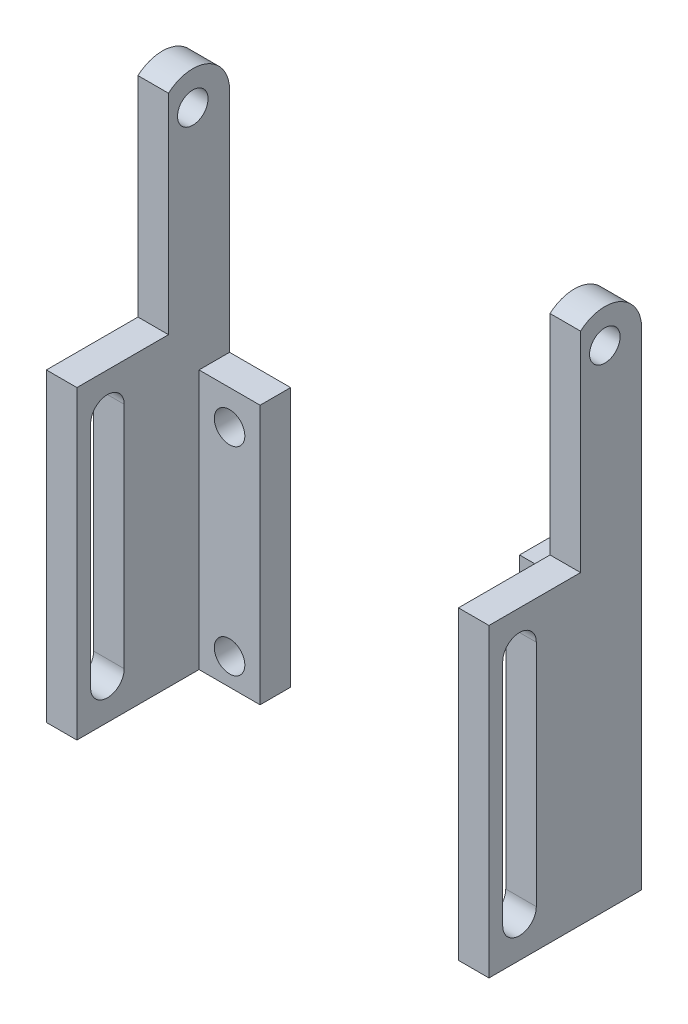
ISO-10303-21;
HEADER;
FILE_DESCRIPTION(('STEP AP214'),'2;1');
FILE_NAME('part.step','',(''),(''),'','','');
FILE_SCHEMA(('AUTOMOTIVE_DESIGN { 1 0 10303 214 1 1 1 1 }'));
ENDSEC;
DATA;
#1=APPLICATION_CONTEXT('core data for automotive mechanical design processes');
#2=APPLICATION_PROTOCOL_DEFINITION('international standard','automotive_design',2000,#1);
#3=PRODUCT_CONTEXT('',#1,'mechanical');
#4=PRODUCT('Part','Part','',(#3));
#5=PRODUCT_RELATED_PRODUCT_CATEGORY('part','',(#4));
#6=PRODUCT_DEFINITION_FORMATION('','',#4);
#7=PRODUCT_DEFINITION_CONTEXT('part definition',#1,'design');
#8=PRODUCT_DEFINITION('design','',#6,#7);
#9=PRODUCT_DEFINITION_SHAPE('','',#8);
#10=(LENGTH_UNIT() NAMED_UNIT(*) SI_UNIT(.MILLI.,.METRE.));
#11=(NAMED_UNIT(*) PLANE_ANGLE_UNIT() SI_UNIT($,.RADIAN.));
#12=(NAMED_UNIT(*) SI_UNIT($,.STERADIAN.) SOLID_ANGLE_UNIT());
#13=UNCERTAINTY_MEASURE_WITH_UNIT(LENGTH_MEASURE(1.E-05),#10,'distance_accuracy_value','');
#14=(GEOMETRIC_REPRESENTATION_CONTEXT(3) GLOBAL_UNCERTAINTY_ASSIGNED_CONTEXT((#13)) GLOBAL_UNIT_ASSIGNED_CONTEXT((#10,
#11,#12)) REPRESENTATION_CONTEXT('',''));
#15=CARTESIAN_POINT('',(0.,0.,0.));
#16=DIRECTION('',(0.,0.,1.));
#17=DIRECTION('',(1.,0.,0.));
#18=AXIS2_PLACEMENT_3D('',#15,#16,#17);
#19=CARTESIAN_POINT('',(0.,0.,0.));
#20=DIRECTION('',(0.,0.,-1.));
#21=DIRECTION('',(-1.,0.,0.));
#22=AXIS2_PLACEMENT_3D('',#19,#20,#21);
#23=PLANE('',#22);
#24=DIRECTION('',(1.,0.,0.));
#25=VECTOR('',#24,1.);
#26=CARTESIAN_POINT('',(-38.9966904051501,-4.30136409154109,0.));
#27=LINE('',#26,#25);
#28=CARTESIAN_POINT('',(-38.9966904051501,-4.30136409154109,0.));
#29=VERTEX_POINT('',#28);
#30=CARTESIAN_POINT('',(-36.9966904051501,-4.30136409154109,0.));
#31=VERTEX_POINT('',#30);
#32=EDGE_CURVE('E148',#29,#31,#27,.T.);
#33=ORIENTED_EDGE('',*,*,#32,.F.);
#34=DIRECTION('',(0.,-1.,0.));
#35=VECTOR('',#34,1.);
#36=CARTESIAN_POINT('',(-38.9966904051501,-3.00000000000008,0.));
#37=LINE('',#36,#35);
#38=CARTESIAN_POINT('',(-38.9966904051501,-18.0000000000001,0.));
#39=VERTEX_POINT('',#38);
#40=EDGE_CURVE('E56',#29,#39,#37,.T.);
#41=ORIENTED_EDGE('',*,*,#40,.T.);
#42=DIRECTION('',(-1.,0.,0.));
#43=VECTOR('',#42,1.);
#44=CARTESIAN_POINT('',(0.,-18.0000000000001,0.));
#45=LINE('',#44,#43);
#46=CARTESIAN_POINT('',(-36.9966904051501,-18.0000000000001,0.));
#47=VERTEX_POINT('',#46);
#48=EDGE_CURVE('E209',#47,#39,#45,.T.);
#49=ORIENTED_EDGE('',*,*,#48,.F.);
#50=DIRECTION('',(0.,-1.,0.));
#51=VECTOR('',#50,1.);
#52=CARTESIAN_POINT('',(-36.9966904051501,-3.00000000000008,0.));
#53=LINE('',#52,#51);
#54=EDGE_CURVE('E12',#31,#47,#53,.T.);
#55=ORIENTED_EDGE('',*,*,#54,.F.);
#56=EDGE_LOOP('',(#33,#41,#49,#55));
#57=FACE_BOUND('',#56,.T.);
#58=ADVANCED_FACE('F47',(#57),#23,.F.);
#59=CARTESIAN_POINT('',(-36.9966904051501,-3.00000000000008,-4.));
#60=DIRECTION('',(-1.,0.,0.));
#61=DIRECTION('',(0.,-1.,0.));
#62=AXIS2_PLACEMENT_3D('',#59,#60,#61);
#63=PLANE('',#62);
#64=CARTESIAN_POINT('',(-36.9966904051501,-5.91214564336537,-1.59013377144661));
#65=DIRECTION('',(-1.,0.,0.));
#66=DIRECTION('',(0.,-1.,0.));
#67=AXIS2_PLACEMENT_3D('',#64,#65,#66);
#68=CIRCLE('',#67,1.);
#69=CARTESIAN_POINT('',(-36.9966904051501,-6.91214564336537,-1.59013377144661));
#70=VERTEX_POINT('',#69);
#71=EDGE_CURVE('E156',#70,#70,#68,.T.);
#72=ORIENTED_EDGE('',*,*,#71,.T.);
#73=EDGE_LOOP('',(#72));
#74=FACE_BOUND('',#73,.T.);
#75=CARTESIAN_POINT('',(-36.9966904051501,-35.5000000000001,3.99999999999999));
#76=DIRECTION('',(-1.,0.,0.));
#77=DIRECTION('',(0.,-1.,0.));
#78=AXIS2_PLACEMENT_3D('',#75,#76,#77);
#79=CIRCLE('',#78,1.1);
#80=CARTESIAN_POINT('',(-36.9966904051501,-35.5000000000001,2.9));
#81=VERTEX_POINT('',#80);
#82=CARTESIAN_POINT('',(-36.9966904051501,-35.5000000000001,5.09999999999999));
#83=VERTEX_POINT('',#82);
#84=EDGE_CURVE('E230',#81,#83,#79,.T.);
#85=ORIENTED_EDGE('',*,*,#84,.T.);
#86=DIRECTION('',(0.,1.,0.));
#87=VECTOR('',#86,1.);
#88=CARTESIAN_POINT('',(-36.9966904051501,-3.00000000000009,5.1));
#89=LINE('',#88,#87);
#90=CARTESIAN_POINT('',(-36.9966904051501,-20.5000000000001,5.1));
#91=VERTEX_POINT('',#90);
#92=EDGE_CURVE('E213',#83,#91,#89,.T.);
#93=ORIENTED_EDGE('',*,*,#92,.T.);
#94=CARTESIAN_POINT('',(-36.9966904051501,-20.5000000000001,4.));
#95=DIRECTION('',(-1.,0.,0.));
#96=DIRECTION('',(0.,-1.,0.));
#97=AXIS2_PLACEMENT_3D('',#94,#95,#96);
#98=CIRCLE('',#97,1.1);
#99=CARTESIAN_POINT('',(-36.9966904051501,-20.5000000000001,2.9));
#100=VERTEX_POINT('',#99);
#101=EDGE_CURVE('E225',#91,#100,#98,.T.);
#102=ORIENTED_EDGE('',*,*,#101,.T.);
#103=DIRECTION('',(0.,1.,0.));
#104=VECTOR('',#103,1.);
#105=CARTESIAN_POINT('',(-36.9966904051501,-3.00000000000009,2.90000000000001));
#106=LINE('',#105,#104);
#107=EDGE_CURVE('E228',#81,#100,#106,.T.);
#108=ORIENTED_EDGE('',*,*,#107,.F.);
#109=EDGE_LOOP('',(#85,#93,#102,#108));
#110=FACE_BOUND('',#109,.T.);
#111=CARTESIAN_POINT('',(-36.9966904051501,-6.11214564336537,-1.59013377144661));
#112=DIRECTION('',(-1.,0.,0.));
#113=DIRECTION('',(0.,-1.,0.));
#114=AXIS2_PLACEMENT_3D('',#111,#112,#113);
#115=CIRCLE('',#114,2.40986622855339);
#116=CARTESIAN_POINT('',(-36.9966904051501,-6.11214564336537,-4.));
#117=VERTEX_POINT('',#116);
#118=EDGE_CURVE('E64',#31,#117,#115,.T.);
#119=ORIENTED_EDGE('',*,*,#118,.F.);
#120=ORIENTED_EDGE('',*,*,#54,.T.);
#121=DIRECTION('',(0.,0.,-1.));
#122=VECTOR('',#121,1.);
#123=CARTESIAN_POINT('',(-36.9966904051501,-18.0000000000001,6.));
#124=LINE('',#123,#122);
#125=CARTESIAN_POINT('',(-36.9966904051501,-18.0000000000001,6.));
#126=VERTEX_POINT('',#125);
#127=EDGE_CURVE('E196',#126,#47,#124,.T.);
#128=ORIENTED_EDGE('',*,*,#127,.F.);
#129=DIRECTION('',(0.,1.,0.));
#130=VECTOR('',#129,1.);
#131=CARTESIAN_POINT('',(-36.9966904051501,0.,6.));
#132=LINE('',#131,#130);
#133=CARTESIAN_POINT('',(-36.9966904051501,-38.0000000000001,6.));
#134=VERTEX_POINT('',#133);
#135=EDGE_CURVE('E212',#134,#126,#132,.T.);
#136=ORIENTED_EDGE('',*,*,#135,.F.);
#137=DIRECTION('',(0.,0.,1.));
#138=VECTOR('',#137,1.);
#139=CARTESIAN_POINT('',(-36.9966904051501,-38.0000000000001,-4.));
#140=LINE('',#139,#138);
#141=CARTESIAN_POINT('',(-36.9966904051501,-38.0000000000001,-2.));
#142=VERTEX_POINT('',#141);
#143=EDGE_CURVE('E163',#142,#134,#140,.T.);
#144=ORIENTED_EDGE('',*,*,#143,.F.);
#145=DIRECTION('',(0.,-1.,0.));
#146=VECTOR('',#145,1.);
#147=CARTESIAN_POINT('',(-36.9966904051501,0.,-2.));
#148=LINE('',#147,#146);
#149=CARTESIAN_POINT('',(-36.9966904051501,-21.0000000000001,-2.));
#150=VERTEX_POINT('',#149);
#151=EDGE_CURVE('E187',#150,#142,#148,.T.);
#152=ORIENTED_EDGE('',*,*,#151,.F.);
#153=DIRECTION('',(0.,0.,-1.));
#154=VECTOR('',#153,1.);
#155=CARTESIAN_POINT('',(-36.9966904051501,-21.0000000000001,-2.));
#156=LINE('',#155,#154);
#157=CARTESIAN_POINT('',(-36.9966904051501,-21.0000000000001,-4.));
#158=VERTEX_POINT('',#157);
#159=EDGE_CURVE('E172',#150,#158,#156,.T.);
#160=ORIENTED_EDGE('',*,*,#159,.T.);
#161=DIRECTION('',(0.,-1.,0.));
#162=VECTOR('',#161,1.);
#163=CARTESIAN_POINT('',(-36.9966904051501,-3.00000000000008,-4.));
#164=LINE('',#163,#162);
#165=EDGE_CURVE('E51',#117,#158,#164,.T.);
#166=ORIENTED_EDGE('',*,*,#165,.F.);
#167=EDGE_LOOP('',(#119,#120,#128,#136,#144,#152,#160,#166));
#168=FACE_BOUND('',#167,.T.);
#169=ADVANCED_FACE('F271',(#74,#110,#168),#63,.F.);
#170=CARTESIAN_POINT('',(-38.9966904051501,-3.00000000000008,-4.));
#171=DIRECTION('',(-1.,0.,0.));
#172=DIRECTION('',(0.,0.,1.));
#173=AXIS2_PLACEMENT_3D('',#170,#171,#172);
#174=PLANE('',#173);
#175=CARTESIAN_POINT('',(-38.9966904051501,-5.91214564336537,-1.59013377144661));
#176=DIRECTION('',(1.,0.,0.));
#177=DIRECTION('',(0.,1.,0.));
#178=AXIS2_PLACEMENT_3D('',#175,#176,#177);
#179=CIRCLE('',#178,1.);
#180=CARTESIAN_POINT('',(-38.9966904051501,-4.91214564336537,-1.59013377144661));
#181=VERTEX_POINT('',#180);
#182=EDGE_CURVE('E259',#181,#181,#179,.T.);
#183=ORIENTED_EDGE('',*,*,#182,.T.);
#184=EDGE_LOOP('',(#183));
#185=FACE_BOUND('',#184,.T.);
#186=DIRECTION('',(0.,-1.,0.));
#187=VECTOR('',#186,1.);
#188=CARTESIAN_POINT('',(-38.9966904051501,0.,5.10000000000001));
#189=LINE('',#188,#187);
#190=CARTESIAN_POINT('',(-38.9966904051501,-20.5000000000001,5.1));
#191=VERTEX_POINT('',#190);
#192=CARTESIAN_POINT('',(-38.9966904051501,-35.5000000000001,5.1));
#193=VERTEX_POINT('',#192);
#194=EDGE_CURVE('E252',#191,#193,#189,.T.);
#195=ORIENTED_EDGE('',*,*,#194,.T.);
#196=CARTESIAN_POINT('',(-38.9966904051501,-35.5000000000001,3.99999999999999));
#197=DIRECTION('',(1.,0.,0.));
#198=DIRECTION('',(0.,1.,0.));
#199=AXIS2_PLACEMENT_3D('',#196,#197,#198);
#200=CIRCLE('',#199,1.1);
#201=CARTESIAN_POINT('',(-38.9966904051501,-35.5000000000001,2.9));
#202=VERTEX_POINT('',#201);
#203=EDGE_CURVE('E249',#193,#202,#200,.T.);
#204=ORIENTED_EDGE('',*,*,#203,.T.);
#205=DIRECTION('',(0.,-1.,0.));
#206=VECTOR('',#205,1.);
#207=CARTESIAN_POINT('',(-38.9966904051501,0.,2.90000000000001));
#208=LINE('',#207,#206);
#209=CARTESIAN_POINT('',(-38.9966904051501,-20.5000000000001,2.9));
#210=VERTEX_POINT('',#209);
#211=EDGE_CURVE('E246',#210,#202,#208,.T.);
#212=ORIENTED_EDGE('',*,*,#211,.F.);
#213=CARTESIAN_POINT('',(-38.9966904051501,-20.5000000000001,4.));
#214=DIRECTION('',(1.,0.,0.));
#215=DIRECTION('',(0.,1.,0.));
#216=AXIS2_PLACEMENT_3D('',#213,#214,#215);
#217=CIRCLE('',#216,1.1);
#218=EDGE_CURVE('E236',#210,#191,#217,.T.);
#219=ORIENTED_EDGE('',*,*,#218,.T.);
#220=EDGE_LOOP('',(#195,#204,#212,#219));
#221=FACE_BOUND('',#220,.T.);
#222=ORIENTED_EDGE('',*,*,#40,.F.);
#223=CARTESIAN_POINT('',(-38.9966904051501,-6.11214564336537,-1.59013377144661));
#224=DIRECTION('',(1.,0.,0.));
#225=DIRECTION('',(0.,1.,0.));
#226=AXIS2_PLACEMENT_3D('',#223,#224,#225);
#227=CIRCLE('',#226,2.40986622855339);
#228=CARTESIAN_POINT('',(-38.9966904051501,-6.11214564336537,-4.));
#229=VERTEX_POINT('',#228);
#230=EDGE_CURVE('E143',#229,#29,#227,.T.);
#231=ORIENTED_EDGE('',*,*,#230,.F.);
#232=DIRECTION('',(0.,-1.,0.));
#233=VECTOR('',#232,1.);
#234=CARTESIAN_POINT('',(-38.9966904051501,-3.00000000000008,-4.));
#235=LINE('',#234,#233);
#236=CARTESIAN_POINT('',(-38.9966904051501,-38.0000000000001,-4.));
#237=VERTEX_POINT('',#236);
#238=EDGE_CURVE('E153',#229,#237,#235,.T.);
#239=ORIENTED_EDGE('',*,*,#238,.T.);
#240=DIRECTION('',(0.,0.,1.));
#241=VECTOR('',#240,1.);
#242=CARTESIAN_POINT('',(-38.9966904051501,-38.0000000000001,-4.));
#243=LINE('',#242,#241);
#244=CARTESIAN_POINT('',(-38.9966904051501,-38.0000000000001,6.));
#245=VERTEX_POINT('',#244);
#246=EDGE_CURVE('E161',#237,#245,#243,.T.);
#247=ORIENTED_EDGE('',*,*,#246,.T.);
#248=DIRECTION('',(0.,-1.,0.));
#249=VECTOR('',#248,1.);
#250=CARTESIAN_POINT('',(-38.9966904051501,0.,6.));
#251=LINE('',#250,#249);
#252=CARTESIAN_POINT('',(-38.9966904051501,-18.0000000000001,6.));
#253=VERTEX_POINT('',#252);
#254=EDGE_CURVE('E216',#253,#245,#251,.T.);
#255=ORIENTED_EDGE('',*,*,#254,.F.);
#256=DIRECTION('',(0.,0.,-1.));
#257=VECTOR('',#256,1.);
#258=CARTESIAN_POINT('',(-38.9966904051501,-18.0000000000001,6.));
#259=LINE('',#258,#257);
#260=EDGE_CURVE('E206',#253,#39,#259,.T.);
#261=ORIENTED_EDGE('',*,*,#260,.T.);
#262=EDGE_LOOP('',(#222,#231,#239,#247,#255,#261));
#263=FACE_BOUND('',#262,.T.);
#264=ADVANCED_FACE('F152',(#185,#221,#263),#174,.T.);
#265=CARTESIAN_POINT('',(0.,0.,-4.));
#266=DIRECTION('',(0.,0.,-1.));
#267=DIRECTION('',(-1.,0.,0.));
#268=AXIS2_PLACEMENT_3D('',#265,#266,#267);
#269=PLANE('',#268);
#270=CARTESIAN_POINT('',(-34.9966904051501,-36.2461665401633,-4.));
#271=DIRECTION('',(0.,0.,-1.));
#272=DIRECTION('',(-1.,0.,0.));
#273=AXIS2_PLACEMENT_3D('',#270,#271,#272);
#274=CIRCLE('',#273,1.00000000001105);
#275=CARTESIAN_POINT('',(-35.9966904051611,-36.2461665401633,-4.));
#276=VERTEX_POINT('',#275);
#277=EDGE_CURVE('E199',#276,#276,#274,.T.);
#278=ORIENTED_EDGE('',*,*,#277,.F.);
#279=EDGE_LOOP('',(#278));
#280=FACE_BOUND('',#279,.T.);
#281=CARTESIAN_POINT('',(-34.9966904051501,-23.2461665401633,-4.));
#282=DIRECTION('',(0.,0.,-1.));
#283=DIRECTION('',(-1.,0.,0.));
#284=AXIS2_PLACEMENT_3D('',#281,#282,#283);
#285=CIRCLE('',#284,1.00000000001105);
#286=CARTESIAN_POINT('',(-35.9966904051611,-23.2461665401633,-4.));
#287=VERTEX_POINT('',#286);
#288=EDGE_CURVE('E192',#287,#287,#285,.T.);
#289=ORIENTED_EDGE('',*,*,#288,.F.);
#290=EDGE_LOOP('',(#289));
#291=FACE_BOUND('',#290,.T.);
#292=ORIENTED_EDGE('',*,*,#238,.F.);
#293=DIRECTION('',(1.,0.,0.));
#294=VECTOR('',#293,1.);
#295=CARTESIAN_POINT('',(-38.9966904051501,-6.11214564336537,-4.));
#296=LINE('',#295,#294);
#297=EDGE_CURVE('E140',#229,#117,#296,.T.);
#298=ORIENTED_EDGE('',*,*,#297,.T.);
#299=ORIENTED_EDGE('',*,*,#165,.T.);
#300=DIRECTION('',(1.,0.,0.));
#301=VECTOR('',#300,1.);
#302=CARTESIAN_POINT('',(0.,-21.0000000000001,-4.));
#303=LINE('',#302,#301);
#304=CARTESIAN_POINT('',(-32.9966904051501,-21.0000000000001,-4.));
#305=VERTEX_POINT('',#304);
#306=EDGE_CURVE('E177',#158,#305,#303,.T.);
#307=ORIENTED_EDGE('',*,*,#306,.T.);
#308=DIRECTION('',(0.,1.,0.));
#309=VECTOR('',#308,1.);
#310=CARTESIAN_POINT('',(-32.9966904051501,0.,-4.));
#311=LINE('',#310,#309);
#312=CARTESIAN_POINT('',(-32.9966904051501,-38.0000000000001,-4.));
#313=VERTEX_POINT('',#312);
#314=EDGE_CURVE('E181',#313,#305,#311,.T.);
#315=ORIENTED_EDGE('',*,*,#314,.F.);
#316=DIRECTION('',(1.,0.,0.));
#317=VECTOR('',#316,1.);
#318=CARTESIAN_POINT('',(-38.9966904051501,-38.0000000000001,-4.));
#319=LINE('',#318,#317);
#320=EDGE_CURVE('E160',#237,#313,#319,.T.);
#321=ORIENTED_EDGE('',*,*,#320,.F.);
#322=EDGE_LOOP('',(#292,#298,#299,#307,#315,#321));
#323=FACE_BOUND('',#322,.T.);
#324=ADVANCED_FACE('F49',(#280,#291,#323),#269,.T.);
#325=CARTESIAN_POINT('',(-38.9966904051501,-38.0000000000001,-4.));
#326=DIRECTION('',(0.,-1.,0.));
#327=DIRECTION('',(1.,0.,0.));
#328=AXIS2_PLACEMENT_3D('',#325,#326,#327);
#329=PLANE('',#328);
#330=ORIENTED_EDGE('',*,*,#143,.T.);
#331=DIRECTION('',(1.,0.,0.));
#332=VECTOR('',#331,1.);
#333=CARTESIAN_POINT('',(1.31838984174237E-13,-38.,6.));
#334=LINE('',#333,#332);
#335=EDGE_CURVE('E208',#245,#134,#334,.T.);
#336=ORIENTED_EDGE('',*,*,#335,.F.);
#337=ORIENTED_EDGE('',*,*,#246,.F.);
#338=ORIENTED_EDGE('',*,*,#320,.T.);
#339=DIRECTION('',(0.,0.,-1.));
#340=VECTOR('',#339,1.);
#341=CARTESIAN_POINT('',(-32.9966904051501,-38.0000000000001,-2.));
#342=LINE('',#341,#340);
#343=CARTESIAN_POINT('',(-32.9966904051501,-38.0000000000001,-2.));
#344=VERTEX_POINT('',#343);
#345=EDGE_CURVE('E169',#344,#313,#342,.T.);
#346=ORIENTED_EDGE('',*,*,#345,.F.);
#347=DIRECTION('',(1.,0.,0.));
#348=VECTOR('',#347,1.);
#349=CARTESIAN_POINT('',(0.,-38.0000000000001,-2.));
#350=LINE('',#349,#348);
#351=EDGE_CURVE('E189',#142,#344,#350,.T.);
#352=ORIENTED_EDGE('',*,*,#351,.F.);
#353=EDGE_LOOP('',(#330,#336,#337,#338,#346,#352));
#354=FACE_BOUND('',#353,.T.);
#355=ADVANCED_FACE('F292',(#354),#329,.T.);
#356=CARTESIAN_POINT('',(-32.9966904051501,0.,-2.));
#357=DIRECTION('',(-1.,0.,0.));
#358=DIRECTION('',(0.,0.,1.));
#359=AXIS2_PLACEMENT_3D('',#356,#357,#358);
#360=PLANE('',#359);
#361=ORIENTED_EDGE('',*,*,#314,.T.);
#362=DIRECTION('',(0.,0.,-1.));
#363=VECTOR('',#362,1.);
#364=CARTESIAN_POINT('',(-32.9966904051501,-21.0000000000001,-2.));
#365=LINE('',#364,#363);
#366=CARTESIAN_POINT('',(-32.9966904051501,-21.0000000000001,-2.));
#367=VERTEX_POINT('',#366);
#368=EDGE_CURVE('E168',#367,#305,#365,.T.);
#369=ORIENTED_EDGE('',*,*,#368,.F.);
#370=DIRECTION('',(0.,1.,0.));
#371=VECTOR('',#370,1.);
#372=CARTESIAN_POINT('',(-32.9966904051501,0.,-2.));
#373=LINE('',#372,#371);
#374=EDGE_CURVE('E180',#344,#367,#373,.T.);
#375=ORIENTED_EDGE('',*,*,#374,.F.);
#376=ORIENTED_EDGE('',*,*,#345,.T.);
#377=EDGE_LOOP('',(#361,#369,#375,#376));
#378=FACE_BOUND('',#377,.T.);
#379=ADVANCED_FACE('F304',(#378),#360,.F.);
#380=CARTESIAN_POINT('',(0.,-21.0000000000001,-2.));
#381=DIRECTION('',(0.,1.,0.));
#382=DIRECTION('',(0.,0.,1.));
#383=AXIS2_PLACEMENT_3D('',#380,#381,#382);
#384=PLANE('',#383);
#385=ORIENTED_EDGE('',*,*,#306,.F.);
#386=ORIENTED_EDGE('',*,*,#159,.F.);
#387=DIRECTION('',(1.,0.,0.));
#388=VECTOR('',#387,1.);
#389=CARTESIAN_POINT('',(0.,-21.0000000000001,-2.));
#390=LINE('',#389,#388);
#391=EDGE_CURVE('E173',#150,#367,#390,.T.);
#392=ORIENTED_EDGE('',*,*,#391,.T.);
#393=ORIENTED_EDGE('',*,*,#368,.T.);
#394=EDGE_LOOP('',(#385,#386,#392,#393));
#395=FACE_BOUND('',#394,.T.);
#396=ADVANCED_FACE('F302',(#395),#384,.T.);
#397=CARTESIAN_POINT('',(0.,0.,-2.));
#398=DIRECTION('',(0.,0.,-1.));
#399=DIRECTION('',(-1.,0.,0.));
#400=AXIS2_PLACEMENT_3D('',#397,#398,#399);
#401=PLANE('',#400);
#402=CARTESIAN_POINT('',(-34.9966904051501,-36.2461665401633,-2.));
#403=DIRECTION('',(0.,0.,-1.));
#404=DIRECTION('',(-1.,0.,0.));
#405=AXIS2_PLACEMENT_3D('',#402,#403,#404);
#406=CIRCLE('',#405,1.00000000001105);
#407=CARTESIAN_POINT('',(-35.9966904051611,-36.2461665401633,-2.));
#408=VERTEX_POINT('',#407);
#409=EDGE_CURVE('E184',#408,#408,#406,.T.);
#410=ORIENTED_EDGE('',*,*,#409,.T.);
#411=EDGE_LOOP('',(#410));
#412=FACE_BOUND('',#411,.T.);
#413=CARTESIAN_POINT('',(-34.9966904051501,-23.2461665401633,-2.));
#414=DIRECTION('',(0.,0.,-1.));
#415=DIRECTION('',(-1.,0.,0.));
#416=AXIS2_PLACEMENT_3D('',#413,#414,#415);
#417=CIRCLE('',#416,1.00000000001105);
#418=CARTESIAN_POINT('',(-35.9966904051611,-23.2461665401633,-2.));
#419=VERTEX_POINT('',#418);
#420=EDGE_CURVE('E195',#419,#419,#417,.T.);
#421=ORIENTED_EDGE('',*,*,#420,.T.);
#422=EDGE_LOOP('',(#421));
#423=FACE_BOUND('',#422,.T.);
#424=ORIENTED_EDGE('',*,*,#374,.T.);
#425=ORIENTED_EDGE('',*,*,#391,.F.);
#426=ORIENTED_EDGE('',*,*,#151,.T.);
#427=ORIENTED_EDGE('',*,*,#351,.T.);
#428=EDGE_LOOP('',(#424,#425,#426,#427));
#429=FACE_BOUND('',#428,.T.);
#430=ADVANCED_FACE('F297',(#412,#423,#429),#401,.F.);
#431=CARTESIAN_POINT('',(-34.9966904051501,-23.2461665401633,-2.));
#432=DIRECTION('',(0.,0.,-1.));
#433=DIRECTION('',(-1.,0.,0.));
#434=AXIS2_PLACEMENT_3D('',#431,#432,#433);
#435=CYLINDRICAL_SURFACE('',#434,1.00000000001105);
#436=ORIENTED_EDGE('',*,*,#420,.F.);
#437=EDGE_LOOP('',(#436));
#438=FACE_BOUND('',#437,.T.);
#439=ORIENTED_EDGE('',*,*,#288,.T.);
#440=EDGE_LOOP('',(#439));
#441=FACE_BOUND('',#440,.T.);
#442=ADVANCED_FACE('F328',(#438,#441),#435,.F.);
#443=CARTESIAN_POINT('',(-34.9966904051501,-36.2461665401633,-2.));
#444=DIRECTION('',(0.,0.,-1.));
#445=DIRECTION('',(-1.,0.,0.));
#446=AXIS2_PLACEMENT_3D('',#443,#444,#445);
#447=CYLINDRICAL_SURFACE('',#446,1.00000000001105);
#448=ORIENTED_EDGE('',*,*,#409,.F.);
#449=EDGE_LOOP('',(#448));
#450=FACE_BOUND('',#449,.T.);
#451=ORIENTED_EDGE('',*,*,#277,.T.);
#452=EDGE_LOOP('',(#451));
#453=FACE_BOUND('',#452,.T.);
#454=ADVANCED_FACE('F330',(#450,#453),#447,.F.);
#455=CARTESIAN_POINT('',(0.,-18.0000000000001,6.));
#456=DIRECTION('',(0.,-1.,0.));
#457=DIRECTION('',(0.,0.,-1.));
#458=AXIS2_PLACEMENT_3D('',#455,#456,#457);
#459=PLANE('',#458);
#460=ORIENTED_EDGE('',*,*,#48,.T.);
#461=ORIENTED_EDGE('',*,*,#260,.F.);
#462=DIRECTION('',(-1.,0.,0.));
#463=VECTOR('',#462,1.);
#464=CARTESIAN_POINT('',(0.,-18.0000000000001,6.));
#465=LINE('',#464,#463);
#466=EDGE_CURVE('E219',#126,#253,#465,.T.);
#467=ORIENTED_EDGE('',*,*,#466,.F.);
#468=ORIENTED_EDGE('',*,*,#127,.T.);
#469=EDGE_LOOP('',(#460,#461,#467,#468));
#470=FACE_BOUND('',#469,.T.);
#471=ADVANCED_FACE('F283',(#470),#459,.F.);
#472=CARTESIAN_POINT('',(0.,0.,6.));
#473=DIRECTION('',(0.,0.,1.));
#474=DIRECTION('',(1.,0.,0.));
#475=AXIS2_PLACEMENT_3D('',#472,#473,#474);
#476=PLANE('',#475);
#477=ORIENTED_EDGE('',*,*,#135,.T.);
#478=ORIENTED_EDGE('',*,*,#466,.T.);
#479=ORIENTED_EDGE('',*,*,#254,.T.);
#480=ORIENTED_EDGE('',*,*,#335,.T.);
#481=EDGE_LOOP('',(#477,#478,#479,#480));
#482=FACE_BOUND('',#481,.T.);
#483=ADVANCED_FACE('F288',(#482),#476,.T.);
#484=CARTESIAN_POINT('',(-38.9966904051501,0.,5.10000000000001));
#485=DIRECTION('',(0.,0.,1.));
#486=DIRECTION('',(0.,-1.,0.));
#487=AXIS2_PLACEMENT_3D('',#484,#485,#486);
#488=PLANE('',#487);
#489=DIRECTION('',(1.,0.,0.));
#490=VECTOR('',#489,1.);
#491=CARTESIAN_POINT('',(-38.9966904051501,-35.5000000000001,5.1));
#492=LINE('',#491,#490);
#493=EDGE_CURVE('E72',#193,#83,#492,.T.);
#494=ORIENTED_EDGE('',*,*,#493,.F.);
#495=ORIENTED_EDGE('',*,*,#194,.F.);
#496=DIRECTION('',(1.,0.,0.));
#497=VECTOR('',#496,1.);
#498=CARTESIAN_POINT('',(-38.9966904051501,-20.5000000000001,5.1));
#499=LINE('',#498,#497);
#500=EDGE_CURVE('E233',#191,#91,#499,.T.);
#501=ORIENTED_EDGE('',*,*,#500,.T.);
#502=ORIENTED_EDGE('',*,*,#92,.F.);
#503=EDGE_LOOP('',(#494,#495,#501,#502));
#504=FACE_BOUND('',#503,.T.);
#505=ADVANCED_FACE('F347',(#504),#488,.F.);
#506=CARTESIAN_POINT('',(-38.9966904051501,-20.5000000000001,4.));
#507=DIRECTION('',(1.,0.,0.));
#508=DIRECTION('',(0.,1.,0.));
#509=AXIS2_PLACEMENT_3D('',#506,#507,#508);
#510=CYLINDRICAL_SURFACE('',#509,1.1);
#511=ORIENTED_EDGE('',*,*,#500,.F.);
#512=ORIENTED_EDGE('',*,*,#218,.F.);
#513=DIRECTION('',(1.,0.,0.));
#514=VECTOR('',#513,1.);
#515=CARTESIAN_POINT('',(-38.9966904051501,-20.5000000000001,2.9));
#516=LINE('',#515,#514);
#517=EDGE_CURVE('E239',#210,#100,#516,.T.);
#518=ORIENTED_EDGE('',*,*,#517,.T.);
#519=ORIENTED_EDGE('',*,*,#101,.F.);
#520=EDGE_LOOP('',(#511,#512,#518,#519));
#521=FACE_BOUND('',#520,.T.);
#522=ADVANCED_FACE('F350',(#521),#510,.F.);
#523=CARTESIAN_POINT('',(-38.9966904051501,0.,2.90000000000001));
#524=DIRECTION('',(0.,0.,1.));
#525=DIRECTION('',(0.,-1.,0.));
#526=AXIS2_PLACEMENT_3D('',#523,#524,#525);
#527=PLANE('',#526);
#528=ORIENTED_EDGE('',*,*,#107,.T.);
#529=ORIENTED_EDGE('',*,*,#517,.F.);
#530=ORIENTED_EDGE('',*,*,#211,.T.);
#531=DIRECTION('',(1.,0.,0.));
#532=VECTOR('',#531,1.);
#533=CARTESIAN_POINT('',(-38.9966904051501,-35.5000000000001,2.9));
#534=LINE('',#533,#532);
#535=EDGE_CURVE('E235',#202,#81,#534,.T.);
#536=ORIENTED_EDGE('',*,*,#535,.T.);
#537=EDGE_LOOP('',(#528,#529,#530,#536));
#538=FACE_BOUND('',#537,.T.);
#539=ADVANCED_FACE('F355',(#538),#527,.T.);
#540=CARTESIAN_POINT('',(-38.9966904051501,-35.5000000000001,3.99999999999999));
#541=DIRECTION('',(1.,0.,0.));
#542=DIRECTION('',(0.,1.,0.));
#543=AXIS2_PLACEMENT_3D('',#540,#541,#542);
#544=CYLINDRICAL_SURFACE('',#543,1.1);
#545=ORIENTED_EDGE('',*,*,#535,.F.);
#546=ORIENTED_EDGE('',*,*,#203,.F.);
#547=ORIENTED_EDGE('',*,*,#493,.T.);
#548=ORIENTED_EDGE('',*,*,#84,.F.);
#549=EDGE_LOOP('',(#545,#546,#547,#548));
#550=FACE_BOUND('',#549,.T.);
#551=ADVANCED_FACE('F352',(#550),#544,.F.);
#552=CARTESIAN_POINT('',(-38.9966904051501,-6.11214564336537,-1.59013377144661));
#553=DIRECTION('',(1.,0.,0.));
#554=DIRECTION('',(0.,1.,0.));
#555=AXIS2_PLACEMENT_3D('',#552,#553,#554);
#556=CYLINDRICAL_SURFACE('',#555,2.40986622855339);
#557=ORIENTED_EDGE('',*,*,#118,.T.);
#558=ORIENTED_EDGE('',*,*,#297,.F.);
#559=ORIENTED_EDGE('',*,*,#230,.T.);
#560=ORIENTED_EDGE('',*,*,#32,.T.);
#561=EDGE_LOOP('',(#557,#558,#559,#560));
#562=FACE_BOUND('',#561,.T.);
#563=ADVANCED_FACE('F142',(#562),#556,.T.);
#564=CARTESIAN_POINT('',(-38.9966904051501,-5.91214564336537,-1.59013377144661));
#565=DIRECTION('',(1.,0.,0.));
#566=DIRECTION('',(0.,1.,0.));
#567=AXIS2_PLACEMENT_3D('',#564,#565,#566);
#568=CYLINDRICAL_SURFACE('',#567,1.);
#569=ORIENTED_EDGE('',*,*,#182,.F.);
#570=EDGE_LOOP('',(#569));
#571=FACE_BOUND('',#570,.T.);
#572=ORIENTED_EDGE('',*,*,#71,.F.);
#573=EDGE_LOOP('',(#572));
#574=FACE_BOUND('',#573,.T.);
#575=ADVANCED_FACE('F265',(#571,#574),#568,.F.);
#576=CLOSED_SHELL('',(#58,#169,#264,#324,#355,#379,#396,#430,#442,#454,#471,#483,#505,#522,#539,
#551,#563,#575));
#577=MANIFOLD_SOLID_BREP('B2',#576);
#578=CARTESIAN_POINT('',(-10.0033095948005,-3.00000000000008,-4.));
#579=DIRECTION('',(-1.,0.,0.));
#580=DIRECTION('',(0.,-1.,0.));
#581=AXIS2_PLACEMENT_3D('',#578,#579,#580);
#582=PLANE('',#581);
#583=CARTESIAN_POINT('',(-10.0033095948005,-5.91214564336536,-1.59013377144661));
#584=DIRECTION('',(1.,0.,0.));
#585=DIRECTION('',(0.,1.,0.));
#586=AXIS2_PLACEMENT_3D('',#583,#584,#585);
#587=CIRCLE('',#586,1.);
#588=CARTESIAN_POINT('',(-10.0033095948005,-4.91214564336536,-1.59013377144661));
#589=VERTEX_POINT('',#588);
#590=EDGE_CURVE('E754',#589,#589,#587,.T.);
#591=ORIENTED_EDGE('',*,*,#590,.F.);
#592=EDGE_LOOP('',(#591));
#593=FACE_BOUND('',#592,.T.);
#594=CARTESIAN_POINT('',(-10.0033095948005,-35.5000000000001,3.99999999999999));
#595=DIRECTION('',(1.,0.,0.));
#596=DIRECTION('',(0.,1.,0.));
#597=AXIS2_PLACEMENT_3D('',#594,#595,#596);
#598=CIRCLE('',#597,1.1);
#599=CARTESIAN_POINT('',(-10.0033095948005,-35.5000000000001,5.09999999999999));
#600=VERTEX_POINT('',#599);
#601=CARTESIAN_POINT('',(-10.0033095948005,-35.5000000000001,2.9));
#602=VERTEX_POINT('',#601);
#603=EDGE_CURVE('E756',#600,#602,#598,.T.);
#604=ORIENTED_EDGE('',*,*,#603,.F.);
#605=DIRECTION('',(0.,-1.,0.));
#606=VECTOR('',#605,1.);
#607=CARTESIAN_POINT('',(-10.0033095948005,0.,5.10000000000001));
#608=LINE('',#607,#606);
#609=CARTESIAN_POINT('',(-10.0033095948005,-20.5000000000001,5.1));
#610=VERTEX_POINT('',#609);
#611=EDGE_CURVE('E517',#610,#600,#608,.T.);
#612=ORIENTED_EDGE('',*,*,#611,.F.);
#613=CARTESIAN_POINT('',(-10.0033095948005,-20.5000000000001,4.));
#614=DIRECTION('',(1.,0.,0.));
#615=DIRECTION('',(0.,1.,0.));
#616=AXIS2_PLACEMENT_3D('',#613,#614,#615);
#617=CIRCLE('',#616,1.1);
#618=CARTESIAN_POINT('',(-10.0033095948005,-20.5000000000001,2.9));
#619=VERTEX_POINT('',#618);
#620=EDGE_CURVE('E640',#619,#610,#617,.T.);
#621=ORIENTED_EDGE('',*,*,#620,.F.);
#622=DIRECTION('',(0.,-1.,0.));
#623=VECTOR('',#622,1.);
#624=CARTESIAN_POINT('',(-10.0033095948005,0.,2.90000000000001));
#625=LINE('',#624,#623);
#626=EDGE_CURVE('E652',#619,#602,#625,.T.);
#627=ORIENTED_EDGE('',*,*,#626,.T.);
#628=EDGE_LOOP('',(#604,#612,#621,#627));
#629=FACE_BOUND('',#628,.T.);
#630=CARTESIAN_POINT('',(-10.0033095948005,-6.11214564336536,-1.59013377144661));
#631=DIRECTION('',(1.,0.,0.));
#632=DIRECTION('',(0.,1.,0.));
#633=AXIS2_PLACEMENT_3D('',#630,#631,#632);
#634=CIRCLE('',#633,2.40986622855339);
#635=CARTESIAN_POINT('',(-10.0033095948005,-6.11214564336536,-4.));
#636=VERTEX_POINT('',#635);
#637=CARTESIAN_POINT('',(-10.0033095948005,-4.30136409154109,0.));
#638=VERTEX_POINT('',#637);
#639=EDGE_CURVE('E588',#636,#638,#634,.T.);
#640=ORIENTED_EDGE('',*,*,#639,.T.);
#641=DIRECTION('',(0.,-1.,0.));
#642=VECTOR('',#641,1.);
#643=CARTESIAN_POINT('',(-10.0033095948005,-3.00000000000008,0.));
#644=LINE('',#643,#642);
#645=CARTESIAN_POINT('',(-10.0033095948005,-18.0000000000001,0.));
#646=VERTEX_POINT('',#645);
#647=EDGE_CURVE('E616',#638,#646,#644,.T.);
#648=ORIENTED_EDGE('',*,*,#647,.T.);
#649=DIRECTION('',(0.,0.,-1.));
#650=VECTOR('',#649,1.);
#651=CARTESIAN_POINT('',(-10.0033095948005,-18.0000000000001,6.));
#652=LINE('',#651,#650);
#653=CARTESIAN_POINT('',(-10.0033095948005,-18.0000000000001,6.));
#654=VERTEX_POINT('',#653);
#655=EDGE_CURVE('E674',#654,#646,#652,.T.);
#656=ORIENTED_EDGE('',*,*,#655,.F.);
#657=DIRECTION('',(0.,1.,0.));
#658=VECTOR('',#657,1.);
#659=CARTESIAN_POINT('',(-10.0033095948005,0.,6.));
#660=LINE('',#659,#658);
#661=CARTESIAN_POINT('',(-10.0033095948005,-38.0000000000001,6.));
#662=VERTEX_POINT('',#661);
#663=EDGE_CURVE('E658',#662,#654,#660,.T.);
#664=ORIENTED_EDGE('',*,*,#663,.F.);
#665=DIRECTION('',(0.,0.,1.));
#666=VECTOR('',#665,1.);
#667=CARTESIAN_POINT('',(-10.0033095948005,-38.0000000000001,-4.));
#668=LINE('',#667,#666);
#669=CARTESIAN_POINT('',(-10.0033095948005,-38.0000000000001,-4.));
#670=VERTEX_POINT('',#669);
#671=EDGE_CURVE('E605',#670,#662,#668,.T.);
#672=ORIENTED_EDGE('',*,*,#671,.F.);
#673=DIRECTION('',(0.,-1.,0.));
#674=VECTOR('',#673,1.);
#675=CARTESIAN_POINT('',(-10.0033095948005,-3.00000000000008,-4.));
#676=LINE('',#675,#674);
#677=EDGE_CURVE('E599',#636,#670,#676,.T.);
#678=ORIENTED_EDGE('',*,*,#677,.F.);
#679=EDGE_LOOP('',(#640,#648,#656,#664,#672,#678));
#680=FACE_BOUND('',#679,.T.);
#681=ADVANCED_FACE('F494',(#593,#629,#680),#582,.F.);
#682=CARTESIAN_POINT('',(-12.0033095948005,-3.00000000000008,-4.));
#683=DIRECTION('',(-1.,0.,0.));
#684=DIRECTION('',(0.,-1.,0.));
#685=AXIS2_PLACEMENT_3D('',#682,#683,#684);
#686=PLANE('',#685);
#687=CARTESIAN_POINT('',(-12.0033095948005,-5.91214564336536,-1.59013377144661));
#688=DIRECTION('',(-1.,0.,0.));
#689=DIRECTION('',(0.,-1.,0.));
#690=AXIS2_PLACEMENT_3D('',#687,#688,#689);
#691=CIRCLE('',#690,1.);
#692=CARTESIAN_POINT('',(-12.0033095948005,-6.91214564336536,-1.59013377144661));
#693=VERTEX_POINT('',#692);
#694=EDGE_CURVE('E498',#693,#693,#691,.T.);
#695=ORIENTED_EDGE('',*,*,#694,.F.);
#696=EDGE_LOOP('',(#695));
#697=FACE_BOUND('',#696,.T.);
#698=DIRECTION('',(0.,1.,0.));
#699=VECTOR('',#698,1.);
#700=CARTESIAN_POINT('',(-12.0033095948005,-3.00000000000008,5.1));
#701=LINE('',#700,#699);
#702=CARTESIAN_POINT('',(-12.0033095948005,-35.5000000000001,5.1));
#703=VERTEX_POINT('',#702);
#704=CARTESIAN_POINT('',(-12.0033095948005,-20.5000000000001,5.1));
#705=VERTEX_POINT('',#704);
#706=EDGE_CURVE('E503',#703,#705,#701,.T.);
#707=ORIENTED_EDGE('',*,*,#706,.F.);
#708=CARTESIAN_POINT('',(-12.0033095948005,-35.5000000000001,3.99999999999999));
#709=DIRECTION('',(-1.,0.,0.));
#710=DIRECTION('',(0.,-1.,0.));
#711=AXIS2_PLACEMENT_3D('',#708,#709,#710);
#712=CIRCLE('',#711,1.1);
#713=CARTESIAN_POINT('',(-12.0033095948005,-35.5000000000001,2.9));
#714=VERTEX_POINT('',#713);
#715=EDGE_CURVE('E619',#714,#703,#712,.T.);
#716=ORIENTED_EDGE('',*,*,#715,.F.);
#717=DIRECTION('',(0.,1.,0.));
#718=VECTOR('',#717,1.);
#719=CARTESIAN_POINT('',(-12.0033095948005,-3.00000000000008,2.90000000000001));
#720=LINE('',#719,#718);
#721=CARTESIAN_POINT('',(-12.0033095948005,-20.5000000000001,2.9));
#722=VERTEX_POINT('',#721);
#723=EDGE_CURVE('E622',#714,#722,#720,.T.);
#724=ORIENTED_EDGE('',*,*,#723,.T.);
#725=CARTESIAN_POINT('',(-12.0033095948005,-20.5000000000001,4.));
#726=DIRECTION('',(-1.,0.,0.));
#727=DIRECTION('',(0.,-1.,0.));
#728=AXIS2_PLACEMENT_3D('',#725,#726,#727);
#729=CIRCLE('',#728,1.1);
#730=EDGE_CURVE('E625',#705,#722,#729,.T.);
#731=ORIENTED_EDGE('',*,*,#730,.F.);
#732=EDGE_LOOP('',(#707,#716,#724,#731));
#733=FACE_BOUND('',#732,.T.);
#734=DIRECTION('',(0.,-1.,0.));
#735=VECTOR('',#734,1.);
#736=CARTESIAN_POINT('',(-12.0033095948005,-3.00000000000008,0.));
#737=LINE('',#736,#735);
#738=CARTESIAN_POINT('',(-12.0033095948005,-4.30136409154109,0.));
#739=VERTEX_POINT('',#738);
#740=CARTESIAN_POINT('',(-12.0033095948005,-18.0000000000001,0.));
#741=VERTEX_POINT('',#740);
#742=EDGE_CURVE('E614',#739,#741,#737,.T.);
#743=ORIENTED_EDGE('',*,*,#742,.F.);
#744=CARTESIAN_POINT('',(-12.0033095948005,-6.11214564336536,-1.59013377144661));
#745=DIRECTION('',(-1.,0.,0.));
#746=DIRECTION('',(0.,-1.,0.));
#747=AXIS2_PLACEMENT_3D('',#744,#745,#746);
#748=CIRCLE('',#747,2.40986622855339);
#749=CARTESIAN_POINT('',(-12.0033095948005,-6.11214564336536,-4.));
#750=VERTEX_POINT('',#749);
#751=EDGE_CURVE('E510',#739,#750,#748,.T.);
#752=ORIENTED_EDGE('',*,*,#751,.T.);
#753=DIRECTION('',(0.,-1.,0.));
#754=VECTOR('',#753,1.);
#755=CARTESIAN_POINT('',(-12.0033095948005,-3.00000000000008,-4.));
#756=LINE('',#755,#754);
#757=CARTESIAN_POINT('',(-12.0033095948005,-21.0000000000001,-4.));
#758=VERTEX_POINT('',#757);
#759=EDGE_CURVE('E602',#750,#758,#756,.T.);
#760=ORIENTED_EDGE('',*,*,#759,.T.);
#761=DIRECTION('',(0.,0.,-1.));
#762=VECTOR('',#761,1.);
#763=CARTESIAN_POINT('',(-12.0033095948005,-21.0000000000001,-2.));
#764=LINE('',#763,#762);
#765=CARTESIAN_POINT('',(-12.0033095948005,-21.0000000000001,-2.));
#766=VERTEX_POINT('',#765);
#767=EDGE_CURVE('E617',#766,#758,#764,.T.);
#768=ORIENTED_EDGE('',*,*,#767,.F.);
#769=DIRECTION('',(0.,1.,0.));
#770=VECTOR('',#769,1.);
#771=CARTESIAN_POINT('',(-12.0033095948005,0.,-2.));
#772=LINE('',#771,#770);
#773=CARTESIAN_POINT('',(-12.0033095948005,-38.0000000000001,-2.));
#774=VERTEX_POINT('',#773);
#775=EDGE_CURVE('E699',#774,#766,#772,.T.);
#776=ORIENTED_EDGE('',*,*,#775,.F.);
#777=DIRECTION('',(0.,0.,1.));
#778=VECTOR('',#777,1.);
#779=CARTESIAN_POINT('',(-12.0033095948005,-38.0000000000001,-4.));
#780=LINE('',#779,#778);
#781=CARTESIAN_POINT('',(-12.0033095948005,-38.0000000000001,6.));
#782=VERTEX_POINT('',#781);
#783=EDGE_CURVE('E607',#774,#782,#780,.T.);
#784=ORIENTED_EDGE('',*,*,#783,.T.);
#785=DIRECTION('',(0.,-1.,0.));
#786=VECTOR('',#785,1.);
#787=CARTESIAN_POINT('',(-12.0033095948005,0.,6.));
#788=LINE('',#787,#786);
#789=CARTESIAN_POINT('',(-12.0033095948005,-18.0000000000001,6.));
#790=VERTEX_POINT('',#789);
#791=EDGE_CURVE('E663',#790,#782,#788,.T.);
#792=ORIENTED_EDGE('',*,*,#791,.F.);
#793=DIRECTION('',(0.,0.,-1.));
#794=VECTOR('',#793,1.);
#795=CARTESIAN_POINT('',(-12.0033095948005,-18.0000000000001,6.));
#796=LINE('',#795,#794);
#797=EDGE_CURVE('E669',#790,#741,#796,.T.);
#798=ORIENTED_EDGE('',*,*,#797,.T.);
#799=EDGE_LOOP('',(#743,#752,#760,#768,#776,#784,#792,#798));
#800=FACE_BOUND('',#799,.T.);
#801=ADVANCED_FACE('F496',(#697,#733,#800),#686,.T.);
#802=CARTESIAN_POINT('',(0.,0.,0.));
#803=DIRECTION('',(0.,0.,1.));
#804=DIRECTION('',(1.,0.,0.));
#805=AXIS2_PLACEMENT_3D('',#802,#803,#804);
#806=PLANE('',#805);
#807=ORIENTED_EDGE('',*,*,#647,.F.);
#808=DIRECTION('',(1.,0.,0.));
#809=VECTOR('',#808,1.);
#810=CARTESIAN_POINT('',(-38.9966904051501,-4.30136409154109,0.));
#811=LINE('',#810,#809);
#812=EDGE_CURVE('E45',#638,#739,#811,.F.);
#813=ORIENTED_EDGE('',*,*,#812,.T.);
#814=ORIENTED_EDGE('',*,*,#742,.T.);
#815=DIRECTION('',(-1.,0.,0.));
#816=VECTOR('',#815,1.);
#817=CARTESIAN_POINT('',(0.,-18.0000000000001,0.));
#818=LINE('',#817,#816);
#819=EDGE_CURVE('E641',#646,#741,#818,.T.);
#820=ORIENTED_EDGE('',*,*,#819,.F.);
#821=EDGE_LOOP('',(#807,#813,#814,#820));
#822=FACE_BOUND('',#821,.T.);
#823=ADVANCED_FACE('F737',(#822),#806,.T.);
#824=CARTESIAN_POINT('',(-10.0033095948005,-38.0000000000001,-4.));
#825=DIRECTION('',(0.,1.,0.));
#826=DIRECTION('',(0.,0.,1.));
#827=AXIS2_PLACEMENT_3D('',#824,#825,#826);
#828=PLANE('',#827);
#829=ORIENTED_EDGE('',*,*,#671,.T.);
#830=DIRECTION('',(1.,0.,0.));
#831=VECTOR('',#830,1.);
#832=CARTESIAN_POINT('',(0.,-38.0000000000001,6.));
#833=LINE('',#832,#831);
#834=EDGE_CURVE('E666',#782,#662,#833,.T.);
#835=ORIENTED_EDGE('',*,*,#834,.F.);
#836=ORIENTED_EDGE('',*,*,#783,.F.);
#837=DIRECTION('',(-1.,0.,0.));
#838=VECTOR('',#837,1.);
#839=CARTESIAN_POINT('',(0.,-38.0000000000001,-2.));
#840=LINE('',#839,#838);
#841=CARTESIAN_POINT('',(-16.0033095948005,-38.0000000000001,-2.));
#842=VERTEX_POINT('',#841);
#843=EDGE_CURVE('E690',#774,#842,#840,.T.);
#844=ORIENTED_EDGE('',*,*,#843,.T.);
#845=DIRECTION('',(0.,0.,-1.));
#846=VECTOR('',#845,1.);
#847=CARTESIAN_POINT('',(-16.0033095948005,-38.0000000000001,-2.));
#848=LINE('',#847,#846);
#849=CARTESIAN_POINT('',(-16.0033095948005,-38.0000000000001,-4.));
#850=VERTEX_POINT('',#849);
#851=EDGE_CURVE('E702',#842,#850,#848,.T.);
#852=ORIENTED_EDGE('',*,*,#851,.T.);
#853=DIRECTION('',(-1.,0.,0.));
#854=VECTOR('',#853,1.);
#855=CARTESIAN_POINT('',(-10.0033095948005,-38.0000000000001,-4.));
#856=LINE('',#855,#854);
#857=EDGE_CURVE('E608',#670,#850,#856,.T.);
#858=ORIENTED_EDGE('',*,*,#857,.F.);
#859=EDGE_LOOP('',(#829,#835,#836,#844,#852,#858));
#860=FACE_BOUND('',#859,.T.);
#861=ADVANCED_FACE('F726',(#860),#828,.F.);
#862=CARTESIAN_POINT('',(0.,0.,-4.));
#863=DIRECTION('',(0.,0.,1.));
#864=DIRECTION('',(1.,0.,0.));
#865=AXIS2_PLACEMENT_3D('',#862,#863,#864);
#866=PLANE('',#865);
#867=CARTESIAN_POINT('',(-14.0033095948005,-36.2461665401633,-4.));
#868=DIRECTION('',(0.,0.,-1.));
#869=DIRECTION('',(-1.,0.,0.));
#870=AXIS2_PLACEMENT_3D('',#867,#868,#869);
#871=CIRCLE('',#870,0.999999999988943);
#872=CARTESIAN_POINT('',(-15.0033095947894,-36.2461665401633,-4.));
#873=VERTEX_POINT('',#872);
#874=EDGE_CURVE('E682',#873,#873,#871,.F.);
#875=ORIENTED_EDGE('',*,*,#874,.T.);
#876=EDGE_LOOP('',(#875));
#877=FACE_BOUND('',#876,.T.);
#878=CARTESIAN_POINT('',(-14.0033095948005,-23.2461665401633,-4.));
#879=DIRECTION('',(0.,0.,-1.));
#880=DIRECTION('',(-1.,0.,0.));
#881=AXIS2_PLACEMENT_3D('',#878,#879,#880);
#882=CIRCLE('',#881,0.999999999988943);
#883=CARTESIAN_POINT('',(-15.0033095947894,-23.2461665401633,-4.));
#884=VERTEX_POINT('',#883);
#885=EDGE_CURVE('E677',#884,#884,#882,.F.);
#886=ORIENTED_EDGE('',*,*,#885,.T.);
#887=EDGE_LOOP('',(#886));
#888=FACE_BOUND('',#887,.T.);
#889=ORIENTED_EDGE('',*,*,#759,.F.);
#890=DIRECTION('',(1.,0.,0.));
#891=VECTOR('',#890,1.);
#892=CARTESIAN_POINT('',(-38.9966904051501,-6.11214564336537,-4.));
#893=LINE('',#892,#891);
#894=EDGE_CURVE('E591',#750,#636,#893,.T.);
#895=ORIENTED_EDGE('',*,*,#894,.T.);
#896=ORIENTED_EDGE('',*,*,#677,.T.);
#897=ORIENTED_EDGE('',*,*,#857,.T.);
#898=DIRECTION('',(0.,1.,0.));
#899=VECTOR('',#898,1.);
#900=CARTESIAN_POINT('',(-16.0033095948005,0.,-4.));
#901=LINE('',#900,#899);
#902=CARTESIAN_POINT('',(-16.0033095948005,-21.0000000000001,-4.));
#903=VERTEX_POINT('',#902);
#904=EDGE_CURVE('E681',#850,#903,#901,.T.);
#905=ORIENTED_EDGE('',*,*,#904,.T.);
#906=DIRECTION('',(-1.,0.,0.));
#907=VECTOR('',#906,1.);
#908=CARTESIAN_POINT('',(0.,-21.0000000000001,-4.));
#909=LINE('',#908,#907);
#910=EDGE_CURVE('E694',#758,#903,#909,.T.);
#911=ORIENTED_EDGE('',*,*,#910,.F.);
#912=EDGE_LOOP('',(#889,#895,#896,#897,#905,#911));
#913=FACE_BOUND('',#912,.T.);
#914=ADVANCED_FACE('F598',(#877,#888,#913),#866,.F.);
#915=CARTESIAN_POINT('',(0.,-21.0000000000001,-2.));
#916=DIRECTION('',(0.,-1.,0.));
#917=DIRECTION('',(0.,0.,-1.));
#918=AXIS2_PLACEMENT_3D('',#915,#916,#917);
#919=PLANE('',#918);
#920=ORIENTED_EDGE('',*,*,#910,.T.);
#921=DIRECTION('',(0.,0.,-1.));
#922=VECTOR('',#921,1.);
#923=CARTESIAN_POINT('',(-16.0033095948005,-21.0000000000001,-2.));
#924=LINE('',#923,#922);
#925=CARTESIAN_POINT('',(-16.0033095948005,-21.0000000000001,-2.));
#926=VERTEX_POINT('',#925);
#927=EDGE_CURVE('E709',#926,#903,#924,.T.);
#928=ORIENTED_EDGE('',*,*,#927,.F.);
#929=DIRECTION('',(-1.,0.,0.));
#930=VECTOR('',#929,1.);
#931=CARTESIAN_POINT('',(0.,-21.0000000000001,-2.));
#932=LINE('',#931,#930);
#933=EDGE_CURVE('E697',#766,#926,#932,.T.);
#934=ORIENTED_EDGE('',*,*,#933,.F.);
#935=ORIENTED_EDGE('',*,*,#767,.T.);
#936=EDGE_LOOP('',(#920,#928,#934,#935));
#937=FACE_BOUND('',#936,.T.);
#938=ADVANCED_FACE('F715',(#937),#919,.F.);
#939=CARTESIAN_POINT('',(-16.0033095948005,0.,-2.));
#940=DIRECTION('',(-1.,0.,0.));
#941=DIRECTION('',(0.,0.,1.));
#942=AXIS2_PLACEMENT_3D('',#939,#940,#941);
#943=PLANE('',#942);
#944=ORIENTED_EDGE('',*,*,#904,.F.);
#945=ORIENTED_EDGE('',*,*,#851,.F.);
#946=DIRECTION('',(0.,1.,0.));
#947=VECTOR('',#946,1.);
#948=CARTESIAN_POINT('',(-16.0033095948005,0.,-2.));
#949=LINE('',#948,#947);
#950=EDGE_CURVE('E693',#842,#926,#949,.T.);
#951=ORIENTED_EDGE('',*,*,#950,.T.);
#952=ORIENTED_EDGE('',*,*,#927,.T.);
#953=EDGE_LOOP('',(#944,#945,#951,#952));
#954=FACE_BOUND('',#953,.T.);
#955=ADVANCED_FACE('F719',(#954),#943,.T.);
#956=CARTESIAN_POINT('',(0.,0.,-2.));
#957=DIRECTION('',(0.,0.,-1.));
#958=DIRECTION('',(-1.,0.,0.));
#959=AXIS2_PLACEMENT_3D('',#956,#957,#958);
#960=PLANE('',#959);
#961=CARTESIAN_POINT('',(-14.0033095948005,-36.2461665401633,-2.));
#962=DIRECTION('',(0.,0.,-1.));
#963=DIRECTION('',(-1.,0.,0.));
#964=AXIS2_PLACEMENT_3D('',#961,#962,#963);
#965=CIRCLE('',#964,0.999999999988943);
#966=CARTESIAN_POINT('',(-15.0033095947894,-36.2461665401633,-2.));
#967=VERTEX_POINT('',#966);
#968=EDGE_CURVE('E678',#967,#967,#965,.F.);
#969=ORIENTED_EDGE('',*,*,#968,.F.);
#970=EDGE_LOOP('',(#969));
#971=FACE_BOUND('',#970,.T.);
#972=CARTESIAN_POINT('',(-14.0033095948005,-23.2461665401633,-2.));
#973=DIRECTION('',(0.,0.,-1.));
#974=DIRECTION('',(-1.,0.,0.));
#975=AXIS2_PLACEMENT_3D('',#972,#973,#974);
#976=CIRCLE('',#975,0.999999999988943);
#977=CARTESIAN_POINT('',(-15.0033095947894,-23.2461665401633,-2.));
#978=VERTEX_POINT('',#977);
#979=EDGE_CURVE('E685',#978,#978,#976,.F.);
#980=ORIENTED_EDGE('',*,*,#979,.F.);
#981=EDGE_LOOP('',(#980));
#982=FACE_BOUND('',#981,.T.);
#983=ORIENTED_EDGE('',*,*,#843,.F.);
#984=ORIENTED_EDGE('',*,*,#775,.T.);
#985=ORIENTED_EDGE('',*,*,#933,.T.);
#986=ORIENTED_EDGE('',*,*,#950,.F.);
#987=EDGE_LOOP('',(#983,#984,#985,#986));
#988=FACE_BOUND('',#987,.T.);
#989=ADVANCED_FACE('F723',(#971,#982,#988),#960,.F.);
#990=CARTESIAN_POINT('',(-14.0033095948005,-23.2461665401633,-2.));
#991=DIRECTION('',(0.,0.,-1.));
#992=DIRECTION('',(-1.,0.,0.));
#993=AXIS2_PLACEMENT_3D('',#990,#991,#992);
#994=CYLINDRICAL_SURFACE('',#993,0.999999999988943);
#995=ORIENTED_EDGE('',*,*,#979,.T.);
#996=EDGE_LOOP('',(#995));
#997=FACE_BOUND('',#996,.T.);
#998=ORIENTED_EDGE('',*,*,#885,.F.);
#999=EDGE_LOOP('',(#998));
#1000=FACE_BOUND('',#999,.T.);
#1001=ADVANCED_FACE('F791',(#997,#1000),#994,.F.);
#1002=CARTESIAN_POINT('',(-14.0033095948005,-36.2461665401633,-2.));
#1003=DIRECTION('',(0.,0.,-1.));
#1004=DIRECTION('',(-1.,0.,0.));
#1005=AXIS2_PLACEMENT_3D('',#1002,#1003,#1004);
#1006=CYLINDRICAL_SURFACE('',#1005,0.999999999988943);
#1007=ORIENTED_EDGE('',*,*,#968,.T.);
#1008=EDGE_LOOP('',(#1007));
#1009=FACE_BOUND('',#1008,.T.);
#1010=ORIENTED_EDGE('',*,*,#874,.F.);
#1011=EDGE_LOOP('',(#1010));
#1012=FACE_BOUND('',#1011,.T.);
#1013=ADVANCED_FACE('F788',(#1009,#1012),#1006,.F.);
#1014=CARTESIAN_POINT('',(0.,-18.0000000000001,6.));
#1015=DIRECTION('',(0.,-1.,0.));
#1016=DIRECTION('',(0.,0.,-1.));
#1017=AXIS2_PLACEMENT_3D('',#1014,#1015,#1016);
#1018=PLANE('',#1017);
#1019=ORIENTED_EDGE('',*,*,#819,.T.);
#1020=ORIENTED_EDGE('',*,*,#797,.F.);
#1021=DIRECTION('',(-1.,0.,0.));
#1022=VECTOR('',#1021,1.);
#1023=CARTESIAN_POINT('',(0.,-18.0000000000001,6.));
#1024=LINE('',#1023,#1022);
#1025=EDGE_CURVE('E661',#654,#790,#1024,.T.);
#1026=ORIENTED_EDGE('',*,*,#1025,.F.);
#1027=ORIENTED_EDGE('',*,*,#655,.T.);
#1028=EDGE_LOOP('',(#1019,#1020,#1026,#1027));
#1029=FACE_BOUND('',#1028,.T.);
#1030=ADVANCED_FACE('F734',(#1029),#1018,.F.);
#1031=CARTESIAN_POINT('',(0.,0.,6.));
#1032=DIRECTION('',(0.,0.,1.));
#1033=DIRECTION('',(1.,0.,0.));
#1034=AXIS2_PLACEMENT_3D('',#1031,#1032,#1033);
#1035=PLANE('',#1034);
#1036=ORIENTED_EDGE('',*,*,#663,.T.);
#1037=ORIENTED_EDGE('',*,*,#1025,.T.);
#1038=ORIENTED_EDGE('',*,*,#791,.T.);
#1039=ORIENTED_EDGE('',*,*,#834,.T.);
#1040=EDGE_LOOP('',(#1036,#1037,#1038,#1039));
#1041=FACE_BOUND('',#1040,.T.);
#1042=ADVANCED_FACE('F730',(#1041),#1035,.T.);
#1043=CARTESIAN_POINT('',(-38.9966904051501,0.,5.10000000000001));
#1044=DIRECTION('',(0.,0.,1.));
#1045=DIRECTION('',(0.,-1.,0.));
#1046=AXIS2_PLACEMENT_3D('',#1043,#1044,#1045);
#1047=PLANE('',#1046);
#1048=ORIENTED_EDGE('',*,*,#706,.T.);
#1049=DIRECTION('',(1.,0.,0.));
#1050=VECTOR('',#1049,1.);
#1051=CARTESIAN_POINT('',(-38.9966904051501,-20.5000000000001,5.1));
#1052=LINE('',#1051,#1050);
#1053=EDGE_CURVE('E630',#705,#610,#1052,.T.);
#1054=ORIENTED_EDGE('',*,*,#1053,.T.);
#1055=ORIENTED_EDGE('',*,*,#611,.T.);
#1056=DIRECTION('',(1.,0.,0.));
#1057=VECTOR('',#1056,1.);
#1058=CARTESIAN_POINT('',(-38.9966904051501,-35.5000000000001,5.1));
#1059=LINE('',#1058,#1057);
#1060=EDGE_CURVE('E632',#703,#600,#1059,.T.);
#1061=ORIENTED_EDGE('',*,*,#1060,.F.);
#1062=EDGE_LOOP('',(#1048,#1054,#1055,#1061));
#1063=FACE_BOUND('',#1062,.T.);
#1064=ADVANCED_FACE('F629',(#1063),#1047,.F.);
#1065=CARTESIAN_POINT('',(-38.9966904051501,-20.5000000000001,4.));
#1066=DIRECTION('',(1.,0.,0.));
#1067=DIRECTION('',(0.,1.,0.));
#1068=AXIS2_PLACEMENT_3D('',#1065,#1066,#1067);
#1069=CYLINDRICAL_SURFACE('',#1068,1.1);
#1070=ORIENTED_EDGE('',*,*,#730,.T.);
#1071=DIRECTION('',(1.,0.,0.));
#1072=VECTOR('',#1071,1.);
#1073=CARTESIAN_POINT('',(-38.9966904051501,-20.5000000000001,2.9));
#1074=LINE('',#1073,#1072);
#1075=EDGE_CURVE('E642',#722,#619,#1074,.T.);
#1076=ORIENTED_EDGE('',*,*,#1075,.T.);
#1077=ORIENTED_EDGE('',*,*,#620,.T.);
#1078=ORIENTED_EDGE('',*,*,#1053,.F.);
#1079=EDGE_LOOP('',(#1070,#1076,#1077,#1078));
#1080=FACE_BOUND('',#1079,.T.);
#1081=ADVANCED_FACE('F637',(#1080),#1069,.F.);
#1082=CARTESIAN_POINT('',(-38.9966904051501,0.,2.90000000000001));
#1083=DIRECTION('',(0.,0.,1.));
#1084=DIRECTION('',(0.,-1.,0.));
#1085=AXIS2_PLACEMENT_3D('',#1082,#1083,#1084);
#1086=PLANE('',#1085);
#1087=DIRECTION('',(1.,0.,0.));
#1088=VECTOR('',#1087,1.);
#1089=CARTESIAN_POINT('',(-38.9966904051501,-35.5000000000001,2.9));
#1090=LINE('',#1089,#1088);
#1091=EDGE_CURVE('E649',#714,#602,#1090,.T.);
#1092=ORIENTED_EDGE('',*,*,#1091,.T.);
#1093=ORIENTED_EDGE('',*,*,#626,.F.);
#1094=ORIENTED_EDGE('',*,*,#1075,.F.);
#1095=ORIENTED_EDGE('',*,*,#723,.F.);
#1096=EDGE_LOOP('',(#1092,#1093,#1094,#1095));
#1097=FACE_BOUND('',#1096,.T.);
#1098=ADVANCED_FACE('F647',(#1097),#1086,.T.);
#1099=CARTESIAN_POINT('',(-38.9966904051501,-35.5000000000001,3.99999999999999));
#1100=DIRECTION('',(1.,0.,0.));
#1101=DIRECTION('',(0.,1.,0.));
#1102=AXIS2_PLACEMENT_3D('',#1099,#1100,#1101);
#1103=CYLINDRICAL_SURFACE('',#1102,1.1);
#1104=ORIENTED_EDGE('',*,*,#715,.T.);
#1105=ORIENTED_EDGE('',*,*,#1060,.T.);
#1106=ORIENTED_EDGE('',*,*,#603,.T.);
#1107=ORIENTED_EDGE('',*,*,#1091,.F.);
#1108=EDGE_LOOP('',(#1104,#1105,#1106,#1107));
#1109=FACE_BOUND('',#1108,.T.);
#1110=ADVANCED_FACE('F773',(#1109),#1103,.F.);
#1111=CARTESIAN_POINT('',(-38.9966904051501,-6.11214564336537,-1.59013377144661));
#1112=DIRECTION('',(1.,0.,0.));
#1113=DIRECTION('',(0.,1.,0.));
#1114=AXIS2_PLACEMENT_3D('',#1111,#1112,#1113);
#1115=CYLINDRICAL_SURFACE('',#1114,2.40986622855339);
#1116=ORIENTED_EDGE('',*,*,#812,.F.);
#1117=ORIENTED_EDGE('',*,*,#639,.F.);
#1118=ORIENTED_EDGE('',*,*,#894,.F.);
#1119=ORIENTED_EDGE('',*,*,#751,.F.);
#1120=EDGE_LOOP('',(#1116,#1117,#1118,#1119));
#1121=FACE_BOUND('',#1120,.T.);
#1122=ADVANCED_FACE('F590',(#1121),#1115,.T.);
#1123=CARTESIAN_POINT('',(-38.9966904051501,-5.91214564336537,-1.59013377144661));
#1124=DIRECTION('',(1.,0.,0.));
#1125=DIRECTION('',(0.,1.,0.));
#1126=AXIS2_PLACEMENT_3D('',#1123,#1124,#1125);
#1127=CYLINDRICAL_SURFACE('',#1126,1.);
#1128=ORIENTED_EDGE('',*,*,#694,.T.);
#1129=EDGE_LOOP('',(#1128));
#1130=FACE_BOUND('',#1129,.T.);
#1131=ORIENTED_EDGE('',*,*,#590,.T.);
#1132=EDGE_LOOP('',(#1131));
#1133=FACE_BOUND('',#1132,.T.);
#1134=ADVANCED_FACE('F767',(#1130,#1133),#1127,.F.);
#1135=CLOSED_SHELL('',(#681,#801,#823,#861,#914,#938,#955,#989,#1001,#1013,#1030,#1042,#1064,
#1081,#1098,#1110,#1122,#1134));
#1136=MANIFOLD_SOLID_BREP('B6',#1135);
#1137=ADVANCED_BREP_SHAPE_REPRESENTATION('',(#18,#577,#1136),#14);
#1138=SHAPE_DEFINITION_REPRESENTATION(#9,#1137);
ENDSEC;
END-ISO-10303-21;
